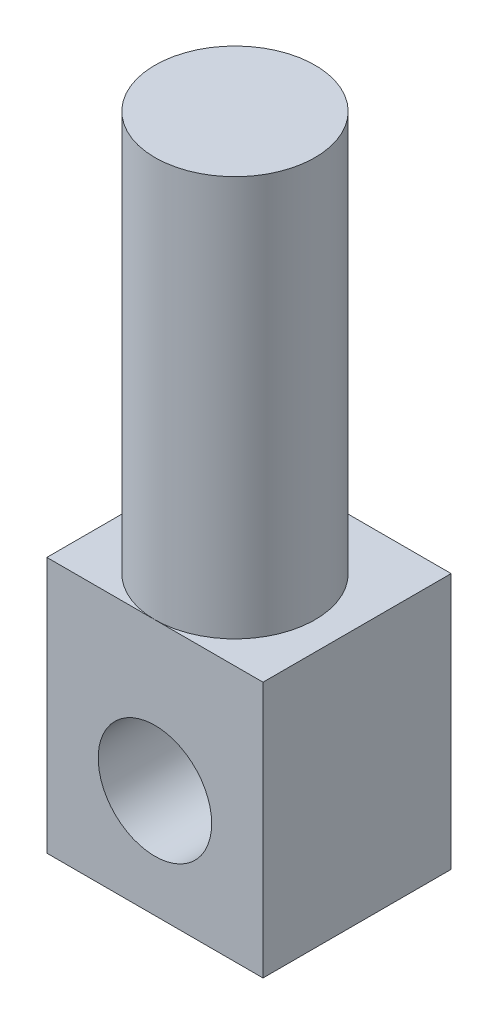
ISO-10303-21;
HEADER;
FILE_DESCRIPTION(('STEP AP214'),'2;1');
FILE_NAME('part.step','',(''),(''),'','','');
FILE_SCHEMA(('AUTOMOTIVE_DESIGN { 1 0 10303 214 1 1 1 1 }'));
ENDSEC;
DATA;
#1=APPLICATION_CONTEXT('core data for automotive mechanical design processes');
#2=APPLICATION_PROTOCOL_DEFINITION('international standard','automotive_design',2000,#1);
#3=PRODUCT_CONTEXT('',#1,'mechanical');
#4=PRODUCT('Part','Part','',(#3));
#5=PRODUCT_RELATED_PRODUCT_CATEGORY('part','',(#4));
#6=PRODUCT_DEFINITION_FORMATION('','',#4);
#7=PRODUCT_DEFINITION_CONTEXT('part definition',#1,'design');
#8=PRODUCT_DEFINITION('design','',#6,#7);
#9=PRODUCT_DEFINITION_SHAPE('','',#8);
#10=(LENGTH_UNIT() NAMED_UNIT(*) SI_UNIT(.MILLI.,.METRE.));
#11=(NAMED_UNIT(*) PLANE_ANGLE_UNIT() SI_UNIT($,.RADIAN.));
#12=(NAMED_UNIT(*) SI_UNIT($,.STERADIAN.) SOLID_ANGLE_UNIT());
#13=UNCERTAINTY_MEASURE_WITH_UNIT(LENGTH_MEASURE(1.E-05),#10,'distance_accuracy_value','');
#14=(GEOMETRIC_REPRESENTATION_CONTEXT(3) GLOBAL_UNCERTAINTY_ASSIGNED_CONTEXT((#13)) GLOBAL_UNIT_ASSIGNED_CONTEXT((#10,
#11,#12)) REPRESENTATION_CONTEXT('',''));
#15=CARTESIAN_POINT('',(0.,0.,0.));
#16=DIRECTION('',(0.,0.,1.));
#17=DIRECTION('',(1.,0.,0.));
#18=AXIS2_PLACEMENT_3D('',#15,#16,#17);
#19=CARTESIAN_POINT('',(75.6163703025469,10.7827771598709,6.858));
#20=DIRECTION('',(-1.,0.,0.));
#21=DIRECTION('',(0.,0.,1.));
#22=AXIS2_PLACEMENT_3D('',#19,#20,#21);
#23=PLANE('',#22);
#24=DIRECTION('',(0.,1.,0.));
#25=VECTOR('',#24,1.);
#26=CARTESIAN_POINT('',(75.6163703025469,10.7827771598709,0.));
#27=LINE('',#26,#25);
#28=CARTESIAN_POINT('',(75.6163703025469,3.9247771598709,0.));
#29=VERTEX_POINT('',#28);
#30=CARTESIAN_POINT('',(75.6163703025469,12.0527771598709,0.));
#31=VERTEX_POINT('',#30);
#32=EDGE_CURVE('E80',#29,#31,#27,.T.);
#33=ORIENTED_EDGE('',*,*,#32,.T.);
#34=DIRECTION('',(0.,0.,-1.));
#35=VECTOR('',#34,1.);
#36=CARTESIAN_POINT('',(75.6163703025469,12.0527771598709,6.858));
#37=LINE('',#36,#35);
#38=CARTESIAN_POINT('',(75.6163703025469,12.0527771598709,5.969));
#39=VERTEX_POINT('',#38);
#40=EDGE_CURVE('E48',#39,#31,#37,.T.);
#41=ORIENTED_EDGE('',*,*,#40,.F.);
#42=DIRECTION('',(0.,1.,0.));
#43=VECTOR('',#42,1.);
#44=CARTESIAN_POINT('',(75.6163703025469,10.7827771598709,5.969));
#45=LINE('',#44,#43);
#46=CARTESIAN_POINT('',(75.6163703025469,3.9247771598709,5.969));
#47=VERTEX_POINT('',#46);
#48=EDGE_CURVE('E106',#47,#39,#45,.T.);
#49=ORIENTED_EDGE('',*,*,#48,.F.);
#50=DIRECTION('',(0.,0.,-1.));
#51=VECTOR('',#50,1.);
#52=CARTESIAN_POINT('',(75.6163703025469,3.9247771598709,6.858));
#53=LINE('',#52,#51);
#54=EDGE_CURVE('E95',#47,#29,#53,.T.);
#55=ORIENTED_EDGE('',*,*,#54,.T.);
#56=EDGE_LOOP('',(#33,#41,#49,#55));
#57=FACE_BOUND('',#56,.T.);
#58=ADVANCED_FACE('F38',(#57),#23,.F.);
#59=CARTESIAN_POINT('',(68.7583703025469,12.0527771598709,6.858));
#60=DIRECTION('',(0.,-1.,0.));
#61=DIRECTION('',(0.,0.,-1.));
#62=AXIS2_PLACEMENT_3D('',#59,#60,#61);
#63=PLANE('',#62);
#64=CARTESIAN_POINT('',(72.1873703025469,12.0527771598709,3.429));
#65=DIRECTION('',(0.,1.,0.));
#66=DIRECTION('',(0.,0.,1.));
#67=AXIS2_PLACEMENT_3D('',#64,#65,#66);
#68=CIRCLE('',#67,2.54);
#69=CARTESIAN_POINT('',(72.1873703025469,12.0527771598709,5.969));
#70=VERTEX_POINT('',#69);
#71=EDGE_CURVE('E12',#70,#70,#68,.T.);
#72=ORIENTED_EDGE('',*,*,#71,.F.);
#73=DIRECTION('',(-1.,0.,0.));
#74=VECTOR('',#73,1.);
#75=CARTESIAN_POINT('',(68.7583703025469,12.0527771598709,5.969));
#76=LINE('',#75,#74);
#77=EDGE_CURVE('E88',#39,#70,#76,.T.);
#78=ORIENTED_EDGE('',*,*,#77,.F.);
#79=ORIENTED_EDGE('',*,*,#40,.T.);
#80=DIRECTION('',(-1.,0.,0.));
#81=VECTOR('',#80,1.);
#82=CARTESIAN_POINT('',(68.7583703025469,12.0527771598709,0.));
#83=LINE('',#82,#81);
#84=CARTESIAN_POINT('',(68.7583703025469,12.0527771598709,0.));
#85=VERTEX_POINT('',#84);
#86=EDGE_CURVE('E74',#31,#85,#83,.T.);
#87=ORIENTED_EDGE('',*,*,#86,.T.);
#88=DIRECTION('',(0.,0.,-1.));
#89=VECTOR('',#88,1.);
#90=CARTESIAN_POINT('',(68.7583703025469,12.0527771598709,6.858));
#91=LINE('',#90,#89);
#92=CARTESIAN_POINT('',(68.7583703025469,12.0527771598709,5.969));
#93=VERTEX_POINT('',#92);
#94=EDGE_CURVE('E92',#93,#85,#91,.T.);
#95=ORIENTED_EDGE('',*,*,#94,.F.);
#96=DIRECTION('',(-1.,0.,0.));
#97=VECTOR('',#96,1.);
#98=CARTESIAN_POINT('',(68.7583703025469,12.0527771598709,5.969));
#99=LINE('',#98,#97);
#100=EDGE_CURVE('E57',#70,#93,#99,.T.);
#101=ORIENTED_EDGE('',*,*,#100,.F.);
#102=EDGE_LOOP('',(#72,#78,#79,#87,#95,#101));
#103=FACE_BOUND('',#102,.T.);
#104=ADVANCED_FACE('F87',(#103),#63,.F.);
#105=CARTESIAN_POINT('',(68.7583703025469,10.7827771598709,6.858));
#106=DIRECTION('',(1.,0.,0.));
#107=DIRECTION('',(0.,0.,-1.));
#108=AXIS2_PLACEMENT_3D('',#105,#106,#107);
#109=PLANE('',#108);
#110=DIRECTION('',(0.,-1.,0.));
#111=VECTOR('',#110,1.);
#112=CARTESIAN_POINT('',(68.7583703025469,10.7827771598709,0.));
#113=LINE('',#112,#111);
#114=CARTESIAN_POINT('',(68.7583703025469,3.9247771598709,0.));
#115=VERTEX_POINT('',#114);
#116=EDGE_CURVE('E82',#85,#115,#113,.T.);
#117=ORIENTED_EDGE('',*,*,#116,.T.);
#118=DIRECTION('',(0.,0.,-1.));
#119=VECTOR('',#118,1.);
#120=CARTESIAN_POINT('',(68.7583703025469,3.9247771598709,6.858));
#121=LINE('',#120,#119);
#122=CARTESIAN_POINT('',(68.7583703025469,3.9247771598709,5.969));
#123=VERTEX_POINT('',#122);
#124=EDGE_CURVE('E108',#123,#115,#121,.T.);
#125=ORIENTED_EDGE('',*,*,#124,.F.);
#126=DIRECTION('',(0.,-1.,0.));
#127=VECTOR('',#126,1.);
#128=CARTESIAN_POINT('',(68.7583703025469,10.7827771598709,5.969));
#129=LINE('',#128,#127);
#130=EDGE_CURVE('E116',#93,#123,#129,.T.);
#131=ORIENTED_EDGE('',*,*,#130,.F.);
#132=ORIENTED_EDGE('',*,*,#94,.T.);
#133=EDGE_LOOP('',(#117,#125,#131,#132));
#134=FACE_BOUND('',#133,.T.);
#135=ADVANCED_FACE('F123',(#134),#109,.F.);
#136=CARTESIAN_POINT('',(68.7583703025469,3.9247771598709,6.858));
#137=DIRECTION('',(0.,1.,0.));
#138=DIRECTION('',(0.,0.,1.));
#139=AXIS2_PLACEMENT_3D('',#136,#137,#138);
#140=PLANE('',#139);
#141=DIRECTION('',(1.,0.,0.));
#142=VECTOR('',#141,1.);
#143=CARTESIAN_POINT('',(68.7583703025469,3.9247771598709,0.));
#144=LINE('',#143,#142);
#145=EDGE_CURVE('E103',#115,#29,#144,.T.);
#146=ORIENTED_EDGE('',*,*,#145,.T.);
#147=ORIENTED_EDGE('',*,*,#54,.F.);
#148=DIRECTION('',(1.,0.,0.));
#149=VECTOR('',#148,1.);
#150=CARTESIAN_POINT('',(68.7583703025469,3.9247771598709,5.969));
#151=LINE('',#150,#149);
#152=EDGE_CURVE('E109',#123,#47,#151,.T.);
#153=ORIENTED_EDGE('',*,*,#152,.F.);
#154=ORIENTED_EDGE('',*,*,#124,.T.);
#155=EDGE_LOOP('',(#146,#147,#153,#154));
#156=FACE_BOUND('',#155,.T.);
#157=ADVANCED_FACE('F151',(#156),#140,.F.);
#158=CARTESIAN_POINT('',(0.,0.,5.969));
#159=DIRECTION('',(0.,0.,1.));
#160=DIRECTION('',(1.,0.,0.));
#161=AXIS2_PLACEMENT_3D('',#158,#159,#160);
#162=PLANE('',#161);
#163=CARTESIAN_POINT('',(72.1873703025469,7.3537771598709,5.969));
#164=DIRECTION('',(0.,0.,1.));
#165=DIRECTION('',(1.,0.,0.));
#166=AXIS2_PLACEMENT_3D('',#163,#164,#165);
#167=CIRCLE('',#166,1.79999999999999);
#168=CARTESIAN_POINT('',(73.9873703025469,7.3537771598709,5.969));
#169=VERTEX_POINT('',#168);
#170=EDGE_CURVE('E99',#169,#169,#167,.T.);
#171=ORIENTED_EDGE('',*,*,#170,.F.);
#172=EDGE_LOOP('',(#171));
#173=FACE_BOUND('',#172,.T.);
#174=ORIENTED_EDGE('',*,*,#48,.T.);
#175=ORIENTED_EDGE('',*,*,#77,.T.);
#176=ORIENTED_EDGE('',*,*,#100,.T.);
#177=ORIENTED_EDGE('',*,*,#130,.T.);
#178=ORIENTED_EDGE('',*,*,#152,.T.);
#179=EDGE_LOOP('',(#174,#175,#176,#177,#178));
#180=FACE_BOUND('',#179,.T.);
#181=ADVANCED_FACE('F127',(#173,#180),#162,.T.);
#182=CARTESIAN_POINT('',(0.,0.,0.));
#183=DIRECTION('',(0.,0.,1.));
#184=DIRECTION('',(1.,0.,0.));
#185=AXIS2_PLACEMENT_3D('',#182,#183,#184);
#186=PLANE('',#185);
#187=CARTESIAN_POINT('',(72.1873703025469,7.3537771598709,0.));
#188=DIRECTION('',(0.,0.,1.));
#189=DIRECTION('',(1.,0.,0.));
#190=AXIS2_PLACEMENT_3D('',#187,#188,#189);
#191=CIRCLE('',#190,1.79999999999999);
#192=CARTESIAN_POINT('',(73.9873703025469,7.3537771598709,0.));
#193=VERTEX_POINT('',#192);
#194=EDGE_CURVE('E96',#193,#193,#191,.T.);
#195=ORIENTED_EDGE('',*,*,#194,.T.);
#196=EDGE_LOOP('',(#195));
#197=FACE_BOUND('',#196,.T.);
#198=ORIENTED_EDGE('',*,*,#32,.F.);
#199=ORIENTED_EDGE('',*,*,#145,.F.);
#200=ORIENTED_EDGE('',*,*,#116,.F.);
#201=ORIENTED_EDGE('',*,*,#86,.F.);
#202=EDGE_LOOP('',(#198,#199,#200,#201));
#203=FACE_BOUND('',#202,.T.);
#204=ADVANCED_FACE('F76',(#197,#203),#186,.F.);
#205=CARTESIAN_POINT('',(72.1873703025469,7.3537771598709,0.));
#206=DIRECTION('',(0.,0.,1.));
#207=DIRECTION('',(1.,0.,0.));
#208=AXIS2_PLACEMENT_3D('',#205,#206,#207);
#209=CYLINDRICAL_SURFACE('',#208,1.79999999999999);
#210=ORIENTED_EDGE('',*,*,#194,.F.);
#211=EDGE_LOOP('',(#210));
#212=FACE_BOUND('',#211,.T.);
#213=ORIENTED_EDGE('',*,*,#170,.T.);
#214=EDGE_LOOP('',(#213));
#215=FACE_BOUND('',#214,.T.);
#216=ADVANCED_FACE('F131',(#212,#215),#209,.F.);
#217=CARTESIAN_POINT('',(72.1873703025469,23.4827771598709,3.429));
#218=DIRECTION('',(0.,-1.,0.));
#219=DIRECTION('',(0.,0.,-1.));
#220=AXIS2_PLACEMENT_3D('',#217,#218,#219);
#221=CYLINDRICAL_SURFACE('',#220,2.54);
#222=CARTESIAN_POINT('',(72.1873703025469,24.7527771598709,3.429));
#223=DIRECTION('',(0.,1.,0.));
#224=DIRECTION('',(0.,0.,1.));
#225=AXIS2_PLACEMENT_3D('',#222,#223,#224);
#226=CIRCLE('',#225,2.54);
#227=CARTESIAN_POINT('',(72.1873703025469,24.7527771598709,5.969));
#228=VERTEX_POINT('',#227);
#229=EDGE_CURVE('E42',#228,#228,#226,.T.);
#230=ORIENTED_EDGE('',*,*,#229,.F.);
#231=EDGE_LOOP('',(#230));
#232=FACE_BOUND('',#231,.T.);
#233=ORIENTED_EDGE('',*,*,#71,.T.);
#234=EDGE_LOOP('',(#233));
#235=FACE_BOUND('',#234,.T.);
#236=ADVANCED_FACE('F129',(#232,#235),#221,.T.);
#237=CARTESIAN_POINT('',(0.,24.7527771598709,0.));
#238=DIRECTION('',(0.,1.,0.));
#239=DIRECTION('',(0.,0.,1.));
#240=AXIS2_PLACEMENT_3D('',#237,#238,#239);
#241=PLANE('',#240);
#242=ORIENTED_EDGE('',*,*,#229,.T.);
#243=EDGE_LOOP('',(#242));
#244=FACE_BOUND('',#243,.T.);
#245=ADVANCED_FACE('F40',(#244),#241,.T.);
#246=CLOSED_SHELL('',(#58,#104,#135,#157,#181,#204,#216,#236,#245));
#247=MANIFOLD_SOLID_BREP('B2',#246);
#248=ADVANCED_BREP_SHAPE_REPRESENTATION('',(#18,#247),#14);
#249=SHAPE_DEFINITION_REPRESENTATION(#9,#248);
ENDSEC;
END-ISO-10303-21;
